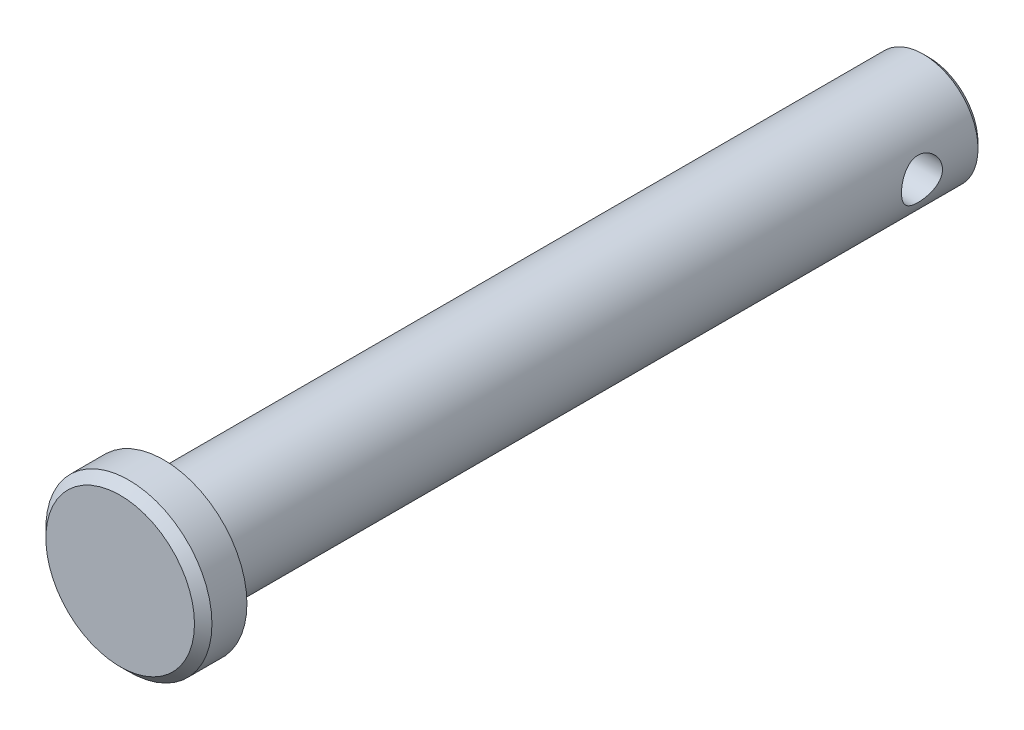
ISO-10303-21;
HEADER;
FILE_DESCRIPTION(('STEP AP214'),'2;1');
FILE_NAME('part.step','',(''),(''),'','','');
FILE_SCHEMA(('AUTOMOTIVE_DESIGN { 1 0 10303 214 1 1 1 1 }'));
ENDSEC;
DATA;
#1=APPLICATION_CONTEXT('core data for automotive mechanical design processes');
#2=APPLICATION_PROTOCOL_DEFINITION('international standard','automotive_design',2000,#1);
#3=PRODUCT_CONTEXT('',#1,'mechanical');
#4=PRODUCT('Part','Part','',(#3));
#5=PRODUCT_RELATED_PRODUCT_CATEGORY('part','',(#4));
#6=PRODUCT_DEFINITION_FORMATION('','',#4);
#7=PRODUCT_DEFINITION_CONTEXT('part definition',#1,'design');
#8=PRODUCT_DEFINITION('design','',#6,#7);
#9=PRODUCT_DEFINITION_SHAPE('','',#8);
#10=(LENGTH_UNIT() NAMED_UNIT(*) SI_UNIT(.MILLI.,.METRE.));
#11=(NAMED_UNIT(*) PLANE_ANGLE_UNIT() SI_UNIT($,.RADIAN.));
#12=(NAMED_UNIT(*) SI_UNIT($,.STERADIAN.) SOLID_ANGLE_UNIT());
#13=UNCERTAINTY_MEASURE_WITH_UNIT(LENGTH_MEASURE(1.E-05),#10,'distance_accuracy_value','');
#14=(GEOMETRIC_REPRESENTATION_CONTEXT(3) GLOBAL_UNCERTAINTY_ASSIGNED_CONTEXT((#13)) GLOBAL_UNIT_ASSIGNED_CONTEXT((#10,
#11,#12)) REPRESENTATION_CONTEXT('',''));
#15=CARTESIAN_POINT('',(0.,0.,0.));
#16=DIRECTION('',(0.,0.,1.));
#17=DIRECTION('',(1.,0.,0.));
#18=AXIS2_PLACEMENT_3D('',#15,#16,#17);
#19=CARTESIAN_POINT('',(0.,0.,22.225));
#20=DIRECTION('',(0.,0.,-1.));
#21=DIRECTION('',(-1.,0.,0.));
#22=AXIS2_PLACEMENT_3D('',#19,#20,#21);
#23=CYLINDRICAL_SURFACE('',#22,3.175);
#24=CARTESIAN_POINT('',(0.,0.,-21.9075));
#25=DIRECTION('',(0.,0.,1.));
#26=DIRECTION('',(1.,0.,0.));
#27=AXIS2_PLACEMENT_3D('',#24,#25,#26);
#28=CIRCLE('',#27,3.175);
#29=CARTESIAN_POINT('',(3.175,0.,-21.9075));
#30=VERTEX_POINT('',#29);
#31=EDGE_CURVE('E51',#30,#30,#28,.T.);
#32=ORIENTED_EDGE('',*,*,#31,.T.);
#33=EDGE_LOOP('',(#32));
#34=FACE_BOUND('',#33,.T.);
#35=CARTESIAN_POINT('',(-3.175,0.,-17.4625));
#36=CARTESIAN_POINT('',(-3.1750017260582,-0.0644803280319207,-17.4624976962969));
#37=CARTESIAN_POINT('',(-3.17301863556027,-0.128944879414298,-17.4677544346972));
#38=CARTESIAN_POINT('',(-3.16530589955499,-0.255947427804687,-17.4885573799955));
#39=CARTESIAN_POINT('',(-3.15957679372107,-0.31848570096517,-17.5041021047485));
#40=CARTESIAN_POINT('',(-3.14498698210789,-0.439785748086511,-17.5448539451563));
#41=CARTESIAN_POINT('',(-3.13613231952368,-0.498554552928809,-17.5700424227273));
#42=CARTESIAN_POINT('',(-3.11617334413749,-0.611028202439703,-17.6292719653313));
#43=CARTESIAN_POINT('',(-3.10506842811866,-0.664731683597443,-17.6633154047757));
#44=CARTESIAN_POINT('',(-3.08122833533403,-0.767831218530125,-17.7407986965375));
#45=CARTESIAN_POINT('',(-3.06844702050705,-0.81698364205751,-17.7845483956684));
#46=CARTESIAN_POINT('',(-3.04292175316615,-0.907450095452759,-17.8795445325105));
#47=CARTESIAN_POINT('',(-3.03017781325932,-0.948761726101172,-17.9307932563948));
#48=CARTESIAN_POINT('',(-3.00563336052824,-1.02392323008938,-18.0417132398466));
#49=CARTESIAN_POINT('',(-2.99388727501525,-1.05742893349134,-18.1016309659457));
#50=CARTESIAN_POINT('',(-2.97338639063462,-1.1137792552768,-18.2267608811213));
#51=CARTESIAN_POINT('',(-2.96463039737105,-1.13662813187984,-18.2919709432544));
#52=CARTESIAN_POINT('',(-2.95159440179158,-1.1700544212018,-18.4230301625799));
#53=CARTESIAN_POINT('',(-2.94714552453477,-1.1810967711723,-18.4887433742581));
#54=CARTESIAN_POINT('',(-2.94273336284839,-1.19205022996996,-18.6212290754076));
#55=CARTESIAN_POINT('',(-2.94276822592073,-1.19196593587088,-18.6880011160129));
#56=CARTESIAN_POINT('',(-2.94717399857943,-1.18102403502952,-18.8164545606378));
#57=CARTESIAN_POINT('',(-2.95128528416453,-1.17081148004022,-18.8782014691726));
#58=CARTESIAN_POINT('',(-2.96294919584751,-1.14096933245487,-18.9990310506342));
#59=CARTESIAN_POINT('',(-2.97050234018472,-1.12133832170212,-19.0581133208748));
#60=CARTESIAN_POINT('',(-2.98835526113513,-1.07286225428949,-19.1732511725093));
#61=CARTESIAN_POINT('',(-2.99870429903106,-1.04384989935074,-19.2292283421088));
#62=CARTESIAN_POINT('',(-3.02096654298085,-0.977551335491415,-19.3357069292128));
#63=CARTESIAN_POINT('',(-3.03288028850369,-0.940262269910618,-19.3862064471563));
#64=CARTESIAN_POINT('',(-3.05790630844421,-0.855517884834482,-19.4838666580229));
#65=CARTESIAN_POINT('',(-3.07104532042939,-0.807547746065835,-19.5305748585938));
#66=CARTESIAN_POINT('',(-3.09635309230243,-0.704304368962599,-19.6154182606759));
#67=CARTESIAN_POINT('',(-3.10852170288599,-0.649030010276034,-19.6535521445933));
#68=CARTESIAN_POINT('',(-3.13075950879707,-0.531592978112735,-19.7206635026684));
#69=CARTESIAN_POINT('',(-3.1407933299357,-0.469337004114248,-19.7494902675942));
#70=CARTESIAN_POINT('',(-3.15736857672026,-0.34038925010389,-19.7961111921393));
#71=CARTESIAN_POINT('',(-3.1639115533356,-0.273699454858829,-19.8139102518954));
#72=CARTESIAN_POINT('',(-3.17249526812277,-0.141585349249254,-19.8371005876114));
#73=CARTESIAN_POINT('',(-3.17475686664138,-0.0762822480275041,-19.8431011938161));
#74=CARTESIAN_POINT('',(-3.17520553124475,0.0544294022336754,-19.8442985319706));
#75=CARTESIAN_POINT('',(-3.17339350069573,0.119837924680552,-19.8394976592514));
#76=CARTESIAN_POINT('',(-3.16604419632035,0.246270501045976,-19.8196914039175));
#77=CARTESIAN_POINT('',(-3.16065273826329,0.307366454105824,-19.8050852121587));
#78=CARTESIAN_POINT('',(-3.1468335994155,0.426197517997295,-19.7666085549156));
#79=CARTESIAN_POINT('',(-3.13840552373861,0.483932190588356,-19.7427368845038));
#80=CARTESIAN_POINT('',(-3.11903764373597,0.596302913556187,-19.6856457851262));
#81=CARTESIAN_POINT('',(-3.1080313141617,0.650798072574001,-19.6521723024289));
#82=CARTESIAN_POINT('',(-3.08472420554452,0.75358046493301,-19.5771150056076));
#83=CARTESIAN_POINT('',(-3.07242294938803,0.801865395464672,-19.5355281972923));
#84=CARTESIAN_POINT('',(-3.04699455283473,0.893786946503483,-19.4425854780639));
#85=CARTESIAN_POINT('',(-3.03386090349835,0.936991348355827,-19.3908027674242));
#86=CARTESIAN_POINT('',(-3.00893809999065,1.01418270962823,-19.2804642133883));
#87=CARTESIAN_POINT('',(-2.99714906660554,1.04816884135274,-19.2219077624604));
#88=CARTESIAN_POINT('',(-2.9762992117158,1.10599357730705,-19.0991998104995));
#89=CARTESIAN_POINT('',(-2.96724991010742,1.12978950323491,-19.0350261079336));
#90=CARTESIAN_POINT('',(-2.95317888607235,1.16608132501843,-18.9031485000728));
#91=CARTESIAN_POINT('',(-2.94815467214383,1.17858421180019,-18.8354468062677));
#92=CARTESIAN_POINT('',(-2.94303366491605,1.1913103800891,-18.7031184233642));
#93=CARTESIAN_POINT('',(-2.94264115340402,1.19227069374821,-18.6385734735747));
#94=CARTESIAN_POINT('',(-2.94606990116575,1.18377268040514,-18.5102934052058));
#95=CARTESIAN_POINT('',(-2.94989076088501,1.17431534131036,-18.4465582104169));
#96=CARTESIAN_POINT('',(-2.96106962383437,1.14582428656505,-18.3236812637937));
#97=CARTESIAN_POINT('',(-2.96831611517726,1.12709164913741,-18.2644586876678));
#98=CARTESIAN_POINT('',(-2.98546478961414,1.08084696819062,-18.1499625026326));
#99=CARTESIAN_POINT('',(-2.99536764396201,1.0533327052505,-18.0946898963443));
#100=CARTESIAN_POINT('',(-3.01735905848772,0.9886321027591,-17.9865124856775));
#101=CARTESIAN_POINT('',(-3.02953498137515,0.9510143603739,-17.9338836800401));
#102=CARTESIAN_POINT('',(-3.05439958363509,0.867842480481136,-17.8354501359791));
#103=CARTESIAN_POINT('',(-3.06708842498621,0.822285820601671,-17.789647575013));
#104=CARTESIAN_POINT('',(-3.09237399534093,0.721582564947798,-17.7036396975664));
#105=CARTESIAN_POINT('',(-3.10492858264887,0.666050423844066,-17.6638713957112));
#106=CARTESIAN_POINT('',(-3.12780770850268,0.548650495915654,-17.5942445173742));
#107=CARTESIAN_POINT('',(-3.13813207344675,0.486782216434432,-17.5643867122343));
#108=CARTESIAN_POINT('',(-3.15574594756552,0.355599271339336,-17.5145883919429));
#109=CARTESIAN_POINT('',(-3.16288465369445,0.286078153898403,-17.4951333924722));
#110=CARTESIAN_POINT('',(-3.17250954730047,0.144363863550066,-17.469093713063));
#111=CARTESIAN_POINT('',(-3.17499806804399,0.0721720492396069,-17.4625025785069));
#112=CARTESIAN_POINT('',(-3.175,0.,-17.4625));
#113=B_SPLINE_CURVE_WITH_KNOTS('',3,(#35,#36,#37,#38,#39,#40,#41,#42,#43,#44,#45,#46,#47,#48,
#49,#50,#51,#52,#53,#54,#55,#56,#57,#58,#59,#60,#61,#62,#63,#64,#65,#66,#67,#68,#69,#70,#71,#72,
#73,#74,#75,#76,#77,#78,#79,#80,#81,#82,#83,#84,#85,#86,#87,#88,#89,#90,#91,#92,#93,#94,#95,#96,
#97,#98,#99,#100,#101,#102,#103,#104,#105,#106,#107,#108,#109,#110,#111,#112),.UNSPECIFIED.,.T.,
.F.,(4,2,2,2,2,2,2,2,2,2,2,2,2,2,2,2,2,2,2,2,2,2,2,2,2,2,2,2,2,2,2,2,2,2,2,2,2,2,4),(0.,
0.193174779988694,0.386321736189804,0.579097274313275,0.771924557565034,0.972134347500304,
1.17240530159712,1.38030485385692,1.58812126298257,1.78741287818416,1.98662215450768,
2.17390936438977,2.36122478335593,2.55208411657196,2.74300942653256,2.94676634210302,
3.15055454712147,3.35749404133323,3.5643415163596,3.76019234336017,3.95599974284977,
4.14428335102049,4.33259145270723,4.52643257351058,4.72034536640771,4.92550862317929,
5.13069029517863,5.33672309214719,5.54262825746728,5.73531018512451,5.92797384230188,
6.11475744301062,6.30158828783603,6.4982127455814,6.69489978960169,6.90223036662895,
7.10957707657801,7.32590383806685,7.54212202675678),.UNSPECIFIED.);
#114=CARTESIAN_POINT('',(-3.175,0.,-17.4625));
#115=VERTEX_POINT('',#114);
#116=EDGE_CURVE('E62',#115,#115,#113,.T.);
#117=ORIENTED_EDGE('',*,*,#116,.T.);
#118=EDGE_LOOP('',(#117));
#119=FACE_BOUND('',#118,.T.);
#120=CARTESIAN_POINT('',(3.175,0.,-19.84375));
#121=CARTESIAN_POINT('',(3.1750017260582,-0.0644803280319207,-19.8437523037031));
#122=CARTESIAN_POINT('',(3.17301863556027,-0.128944879414298,-19.8384955653029));
#123=CARTESIAN_POINT('',(3.16530589955499,-0.255947427804687,-19.8176926200045));
#124=CARTESIAN_POINT('',(3.15957679372107,-0.31848570096517,-19.8021478952515));
#125=CARTESIAN_POINT('',(3.14498698210789,-0.439785748086511,-19.7613960548437));
#126=CARTESIAN_POINT('',(3.13613231952368,-0.498554552928809,-19.7362075772727));
#127=CARTESIAN_POINT('',(3.11617334413749,-0.611028202439703,-19.6769780346687));
#128=CARTESIAN_POINT('',(3.10506842811866,-0.664731683597443,-19.6429345952243));
#129=CARTESIAN_POINT('',(3.08122833533403,-0.767831218530125,-19.5654513034625));
#130=CARTESIAN_POINT('',(3.06844702050705,-0.81698364205751,-19.5217016043316));
#131=CARTESIAN_POINT('',(3.04292175316615,-0.907450095452759,-19.4267054674896));
#132=CARTESIAN_POINT('',(3.03017781325932,-0.948761726101172,-19.3754567436053));
#133=CARTESIAN_POINT('',(3.00563336052824,-1.02392323008938,-19.2645367601535));
#134=CARTESIAN_POINT('',(2.99388727501525,-1.05742893349134,-19.2046190340543));
#135=CARTESIAN_POINT('',(2.97338639063462,-1.1137792552768,-19.0794891188787));
#136=CARTESIAN_POINT('',(2.96463039737105,-1.13662813187984,-19.0142790567456));
#137=CARTESIAN_POINT('',(2.95159440179158,-1.1700544212018,-18.8832198374201));
#138=CARTESIAN_POINT('',(2.94714552453477,-1.1810967711723,-18.8175066257419));
#139=CARTESIAN_POINT('',(2.94273336284839,-1.19205022996996,-18.6850209245924));
#140=CARTESIAN_POINT('',(2.94276822592073,-1.19196593587088,-18.6182488839871));
#141=CARTESIAN_POINT('',(2.94717399857943,-1.18102403502952,-18.4897954393622));
#142=CARTESIAN_POINT('',(2.95128528416453,-1.17081148004022,-18.4280485308274));
#143=CARTESIAN_POINT('',(2.96294919584751,-1.14096933245487,-18.3072189493658));
#144=CARTESIAN_POINT('',(2.97050234018472,-1.12133832170212,-18.2481366791252));
#145=CARTESIAN_POINT('',(2.98835526113513,-1.07286225428949,-18.1329988274907));
#146=CARTESIAN_POINT('',(2.99870429903106,-1.04384989935074,-18.0770216578912));
#147=CARTESIAN_POINT('',(3.02096654298085,-0.977551335491415,-17.9705430707872));
#148=CARTESIAN_POINT('',(3.03288028850369,-0.940262269910618,-17.9200435528437));
#149=CARTESIAN_POINT('',(3.05790630844421,-0.855517884834483,-17.8223833419771));
#150=CARTESIAN_POINT('',(3.07104532042938,-0.807547746065836,-17.7756751414062));
#151=CARTESIAN_POINT('',(3.09635309230243,-0.7043043689626,-17.6908317393241));
#152=CARTESIAN_POINT('',(3.10852170288599,-0.649030010276035,-17.6526978554067));
#153=CARTESIAN_POINT('',(3.13075950879707,-0.531592978112735,-17.5855864973316));
#154=CARTESIAN_POINT('',(3.1407933299357,-0.469337004114248,-17.5567597324058));
#155=CARTESIAN_POINT('',(3.15736857672026,-0.34038925010389,-17.5101388078607));
#156=CARTESIAN_POINT('',(3.1639115533356,-0.273699454858829,-17.4923397481046));
#157=CARTESIAN_POINT('',(3.17249526812277,-0.141585349249254,-17.4691494123886));
#158=CARTESIAN_POINT('',(3.17475686664138,-0.0762822480275041,-17.4631488061839));
#159=CARTESIAN_POINT('',(3.17520553124475,0.0544294022336755,-17.4619514680294));
#160=CARTESIAN_POINT('',(3.17339350069573,0.119837924680552,-17.4667523407486));
#161=CARTESIAN_POINT('',(3.16604419632035,0.246270501045976,-17.4865585960825));
#162=CARTESIAN_POINT('',(3.16065273826329,0.307366454105823,-17.5011647878413));
#163=CARTESIAN_POINT('',(3.1468335994155,0.426197517997294,-17.5396414450844));
#164=CARTESIAN_POINT('',(3.13840552373861,0.483932190588356,-17.5635131154963));
#165=CARTESIAN_POINT('',(3.11903764373597,0.596302913556187,-17.6206042148738));
#166=CARTESIAN_POINT('',(3.1080313141617,0.650798072574001,-17.6540776975711));
#167=CARTESIAN_POINT('',(3.08472420554452,0.75358046493301,-17.7291349943924));
#168=CARTESIAN_POINT('',(3.07242294938803,0.801865395464672,-17.7707218027077));
#169=CARTESIAN_POINT('',(3.04699455283473,0.893786946503483,-17.8636645219361));
#170=CARTESIAN_POINT('',(3.03386090349835,0.936991348355827,-17.9154472325758));
#171=CARTESIAN_POINT('',(3.00893809999065,1.01418270962823,-18.0257857866117));
#172=CARTESIAN_POINT('',(2.99714906660554,1.04816884135274,-18.0843422375396));
#173=CARTESIAN_POINT('',(2.9762992117158,1.10599357730705,-18.2070501895005));
#174=CARTESIAN_POINT('',(2.96724991010741,1.12978950323492,-18.2712238920664));
#175=CARTESIAN_POINT('',(2.95317888607235,1.16608132501844,-18.4031014999272));
#176=CARTESIAN_POINT('',(2.94815467214383,1.17858421180019,-18.4708031937323));
#177=CARTESIAN_POINT('',(2.94303366491605,1.1913103800891,-18.6031315766358));
#178=CARTESIAN_POINT('',(2.94264115340402,1.19227069374821,-18.6676765264253));
#179=CARTESIAN_POINT('',(2.94606990116575,1.18377268040514,-18.7959565947942));
#180=CARTESIAN_POINT('',(2.94989076088501,1.17431534131036,-18.8596917895831));
#181=CARTESIAN_POINT('',(2.96106962383437,1.14582428656505,-18.9825687362063));
#182=CARTESIAN_POINT('',(2.96831611517726,1.12709164913741,-19.0417913123322));
#183=CARTESIAN_POINT('',(2.98546478961414,1.08084696819062,-19.1562874973674));
#184=CARTESIAN_POINT('',(2.99536764396201,1.0533327052505,-19.2115601036557));
#185=CARTESIAN_POINT('',(3.01735905848772,0.9886321027591,-19.3197375143225));
#186=CARTESIAN_POINT('',(3.02953498137515,0.951014360373899,-19.3723663199599));
#187=CARTESIAN_POINT('',(3.05439958363509,0.867842480481135,-19.4707998640209));
#188=CARTESIAN_POINT('',(3.06708842498621,0.82228582060167,-19.516602424987));
#189=CARTESIAN_POINT('',(3.09237399534093,0.721582564947798,-19.6026103024336));
#190=CARTESIAN_POINT('',(3.10492858264887,0.666050423844066,-19.6423786042888));
#191=CARTESIAN_POINT('',(3.12780770850268,0.548650495915654,-19.7120054826258));
#192=CARTESIAN_POINT('',(3.13813207344675,0.486782216434432,-19.7418632877657));
#193=CARTESIAN_POINT('',(3.15574594756552,0.355599271339336,-19.7916616080571));
#194=CARTESIAN_POINT('',(3.16288465369445,0.286078153898404,-19.8111166075278));
#195=CARTESIAN_POINT('',(3.17250954730047,0.144363863550066,-19.837156286937));
#196=CARTESIAN_POINT('',(3.17499806804399,0.0721720492396071,-19.8437474214931));
#197=CARTESIAN_POINT('',(3.175,0.,-19.84375));
#198=B_SPLINE_CURVE_WITH_KNOTS('',3,(#120,#121,#122,#123,#124,#125,#126,#127,#128,#129,#130,
#131,#132,#133,#134,#135,#136,#137,#138,#139,#140,#141,#142,#143,#144,#145,#146,#147,#148,#149,
#150,#151,#152,#153,#154,#155,#156,#157,#158,#159,#160,#161,#162,#163,#164,#165,#166,#167,#168,
#169,#170,#171,#172,#173,#174,#175,#176,#177,#178,#179,#180,#181,#182,#183,#184,#185,#186,#187,
#188,#189,#190,#191,#192,#193,#194,#195,#196,#197),.UNSPECIFIED.,.T.,.F.,(4,2,2,2,2,2,2,2,2,2,2,
2,2,2,2,2,2,2,2,2,2,2,2,2,2,2,2,2,2,2,2,2,2,2,2,2,2,2,4),(0.,0.193174779988694,
0.386321736189804,0.579097274313275,0.771924557565034,0.972134347500304,1.17240530159712,
1.38030485385692,1.58812126298257,1.78741287818416,1.98662215450768,2.17390936438977,
2.36122478335593,2.55208411657196,2.74300942653256,2.94676634210302,3.15055454712147,
3.35749404133323,3.5643415163596,3.76019234336017,3.95599974284977,4.14428335102049,
4.33259145270723,4.52643257351058,4.72034536640771,4.92550862317929,5.13069029517863,
5.3367230921472,5.54262825746729,5.73531018512451,5.92797384230188,6.11475744301061,
6.30158828783603,6.49821274558141,6.69489978960169,6.90223036662895,7.10957707657801,
7.32590383806685,7.54212202675678),.UNSPECIFIED.);
#199=CARTESIAN_POINT('',(3.175,0.,-19.84375));
#200=VERTEX_POINT('',#199);
#201=EDGE_CURVE('E71',#200,#200,#198,.T.);
#202=ORIENTED_EDGE('',*,*,#201,.T.);
#203=EDGE_LOOP('',(#202));
#204=FACE_BOUND('',#203,.T.);
#205=CARTESIAN_POINT('',(0.,0.,22.225));
#206=DIRECTION('',(0.,0.,1.));
#207=DIRECTION('',(1.,0.,0.));
#208=AXIS2_PLACEMENT_3D('',#205,#206,#207);
#209=CIRCLE('',#208,3.175);
#210=CARTESIAN_POINT('',(3.175,0.,22.225));
#211=VERTEX_POINT('',#210);
#212=EDGE_CURVE('E110',#211,#211,#209,.T.);
#213=ORIENTED_EDGE('',*,*,#212,.F.);
#214=EDGE_LOOP('',(#213));
#215=FACE_BOUND('',#214,.T.);
#216=ADVANCED_FACE('F44',(#34,#119,#204,#215),#23,.T.);
#217=CARTESIAN_POINT('',(0.,0.,-22.225));
#218=DIRECTION('',(0.,0.,1.));
#219=DIRECTION('',(1.,0.,0.));
#220=AXIS2_PLACEMENT_3D('',#217,#218,#219);
#221=PLANE('',#220);
#222=CARTESIAN_POINT('',(0.,0.,-22.225));
#223=DIRECTION('',(0.,0.,1.));
#224=DIRECTION('',(1.,0.,0.));
#225=AXIS2_PLACEMENT_3D('',#222,#223,#224);
#226=CIRCLE('',#225,2.85750000000001);
#227=CARTESIAN_POINT('',(2.85750000000001,0.,-22.225));
#228=VERTEX_POINT('',#227);
#229=EDGE_CURVE('E12',#228,#228,#226,.F.);
#230=ORIENTED_EDGE('',*,*,#229,.T.);
#231=EDGE_LOOP('',(#230));
#232=FACE_BOUND('',#231,.T.);
#233=ADVANCED_FACE('F92',(#232),#221,.F.);
#234=CARTESIAN_POINT('',(0.,0.,22.225));
#235=DIRECTION('',(0.,0.,1.));
#236=DIRECTION('',(1.,0.,0.));
#237=AXIS2_PLACEMENT_3D('',#234,#235,#236);
#238=PLANE('',#237);
#239=CARTESIAN_POINT('',(0.,0.,22.225));
#240=DIRECTION('',(0.,0.,1.));
#241=DIRECTION('',(1.,0.,0.));
#242=AXIS2_PLACEMENT_3D('',#239,#240,#241);
#243=CIRCLE('',#242,4.826);
#244=CARTESIAN_POINT('',(4.826,0.,22.225));
#245=VERTEX_POINT('',#244);
#246=EDGE_CURVE('E70',#245,#245,#243,.T.);
#247=ORIENTED_EDGE('',*,*,#246,.F.);
#248=EDGE_LOOP('',(#247));
#249=FACE_BOUND('',#248,.T.);
#250=ORIENTED_EDGE('',*,*,#212,.T.);
#251=EDGE_LOOP('',(#250));
#252=FACE_BOUND('',#251,.T.);
#253=ADVANCED_FACE('F89',(#249,#252),#238,.F.);
#254=CARTESIAN_POINT('',(0.,0.,24.765));
#255=DIRECTION('',(0.,0.,-1.));
#256=DIRECTION('',(-1.,0.,0.));
#257=AXIS2_PLACEMENT_3D('',#254,#255,#256);
#258=CYLINDRICAL_SURFACE('',#257,4.826);
#259=CARTESIAN_POINT('',(0.,0.,24.257));
#260=DIRECTION('',(0.,0.,1.));
#261=DIRECTION('',(1.,0.,0.));
#262=AXIS2_PLACEMENT_3D('',#259,#260,#261);
#263=CIRCLE('',#262,4.826);
#264=CARTESIAN_POINT('',(4.826,0.,24.257));
#265=VERTEX_POINT('',#264);
#266=EDGE_CURVE('E55',#265,#265,#263,.F.);
#267=ORIENTED_EDGE('',*,*,#266,.T.);
#268=EDGE_LOOP('',(#267));
#269=FACE_BOUND('',#268,.T.);
#270=ORIENTED_EDGE('',*,*,#246,.T.);
#271=EDGE_LOOP('',(#270));
#272=FACE_BOUND('',#271,.T.);
#273=ADVANCED_FACE('F87',(#269,#272),#258,.T.);
#274=CARTESIAN_POINT('',(0.,0.,24.765));
#275=DIRECTION('',(0.,0.,1.));
#276=DIRECTION('',(1.,0.,0.));
#277=AXIS2_PLACEMENT_3D('',#274,#275,#276);
#278=PLANE('',#277);
#279=CARTESIAN_POINT('',(0.,0.,24.765));
#280=DIRECTION('',(0.,0.,1.));
#281=DIRECTION('',(1.,0.,0.));
#282=AXIS2_PLACEMENT_3D('',#279,#280,#281);
#283=CIRCLE('',#282,4.31799999999999);
#284=CARTESIAN_POINT('',(4.31799999999999,0.,24.765));
#285=VERTEX_POINT('',#284);
#286=EDGE_CURVE('E59',#285,#285,#283,.T.);
#287=ORIENTED_EDGE('',*,*,#286,.T.);
#288=EDGE_LOOP('',(#287));
#289=FACE_BOUND('',#288,.T.);
#290=ADVANCED_FACE('F83',(#289),#278,.T.);
#291=CARTESIAN_POINT('',(0.,0.,24.765));
#292=DIRECTION('',(0.,0.,-1.));
#293=DIRECTION('',(-1.,0.,0.));
#294=AXIS2_PLACEMENT_3D('',#291,#292,#293);
#295=CONICAL_SURFACE('',#294,4.31799999999999,0.785398163397447);
#296=ORIENTED_EDGE('',*,*,#266,.F.);
#297=EDGE_LOOP('',(#296));
#298=FACE_BOUND('',#297,.T.);
#299=ORIENTED_EDGE('',*,*,#286,.F.);
#300=EDGE_LOOP('',(#299));
#301=FACE_BOUND('',#300,.T.);
#302=ADVANCED_FACE('F81',(#298,#301),#295,.T.);
#303=CARTESIAN_POINT('',(-4.826,0.,-18.653125));
#304=DIRECTION('',(1.,0.,0.));
#305=DIRECTION('',(0.,0.,-1.));
#306=AXIS2_PLACEMENT_3D('',#303,#304,#305);
#307=CYLINDRICAL_SURFACE('',#306,1.190625);
#308=ORIENTED_EDGE('',*,*,#201,.F.);
#309=EDGE_LOOP('',(#308));
#310=FACE_BOUND('',#309,.T.);
#311=ORIENTED_EDGE('',*,*,#116,.F.);
#312=EDGE_LOOP('',(#311));
#313=FACE_BOUND('',#312,.T.);
#314=ADVANCED_FACE('F77',(#310,#313),#307,.F.);
#315=CARTESIAN_POINT('',(0.,0.,-21.9075));
#316=DIRECTION('',(0.,0.,1.));
#317=DIRECTION('',(1.,0.,0.));
#318=AXIS2_PLACEMENT_3D('',#315,#316,#317);
#319=CONICAL_SURFACE('',#318,3.175,0.785398163397442);
#320=ORIENTED_EDGE('',*,*,#229,.F.);
#321=EDGE_LOOP('',(#320));
#322=FACE_BOUND('',#321,.T.);
#323=ORIENTED_EDGE('',*,*,#31,.F.);
#324=EDGE_LOOP('',(#323));
#325=FACE_BOUND('',#324,.T.);
#326=ADVANCED_FACE('F46',(#322,#325),#319,.T.);
#327=CLOSED_SHELL('',(#216,#233,#253,#273,#290,#302,#314,#326));
#328=MANIFOLD_SOLID_BREP('B2',#327);
#329=ADVANCED_BREP_SHAPE_REPRESENTATION('',(#18,#328),#14);
#330=SHAPE_DEFINITION_REPRESENTATION(#9,#329);
ENDSEC;
END-ISO-10303-21;
